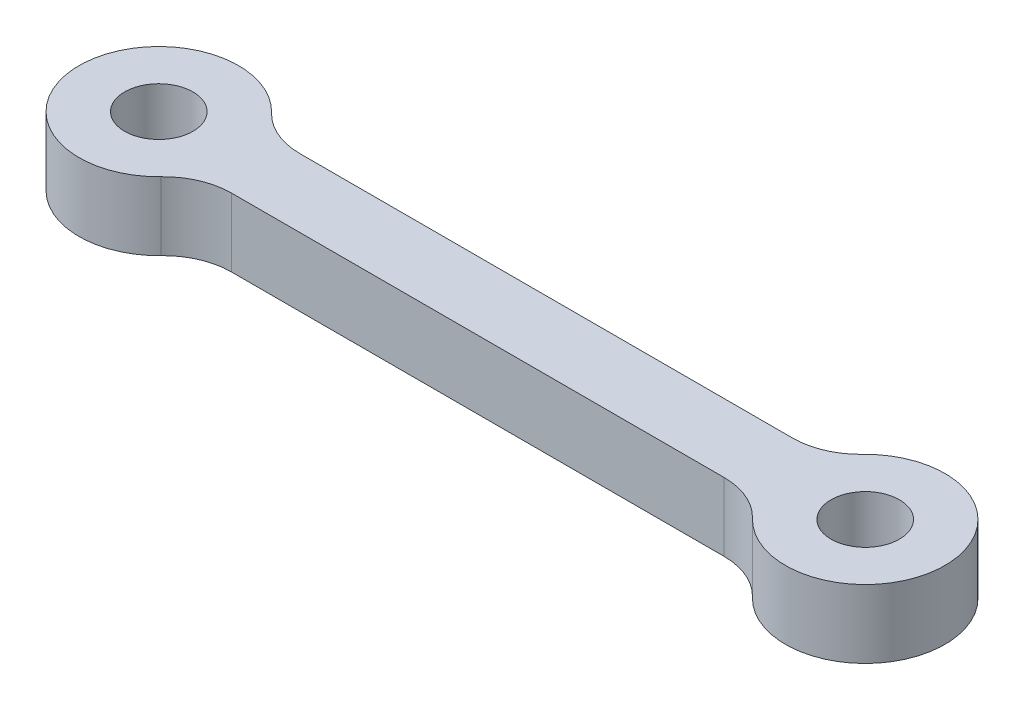
ISO-10303-21;
HEADER;
FILE_DESCRIPTION(('STEP AP214'),'2;1');
FILE_NAME('part.step','',(''),(''),'','','');
FILE_SCHEMA(('AUTOMOTIVE_DESIGN { 1 0 10303 214 1 1 1 1 }'));
ENDSEC;
DATA;
#1=APPLICATION_CONTEXT('core data for automotive mechanical design processes');
#2=APPLICATION_PROTOCOL_DEFINITION('international standard','automotive_design',2000,#1);
#3=PRODUCT_CONTEXT('',#1,'mechanical');
#4=PRODUCT('Part','Part','',(#3));
#5=PRODUCT_RELATED_PRODUCT_CATEGORY('part','',(#4));
#6=PRODUCT_DEFINITION_FORMATION('','',#4);
#7=PRODUCT_DEFINITION_CONTEXT('part definition',#1,'design');
#8=PRODUCT_DEFINITION('design','',#6,#7);
#9=PRODUCT_DEFINITION_SHAPE('','',#8);
#10=(LENGTH_UNIT() NAMED_UNIT(*) SI_UNIT(.MILLI.,.METRE.));
#11=(NAMED_UNIT(*) PLANE_ANGLE_UNIT() SI_UNIT($,.RADIAN.));
#12=(NAMED_UNIT(*) SI_UNIT($,.STERADIAN.) SOLID_ANGLE_UNIT());
#13=UNCERTAINTY_MEASURE_WITH_UNIT(LENGTH_MEASURE(1.E-05),#10,'distance_accuracy_value','');
#14=(GEOMETRIC_REPRESENTATION_CONTEXT(3) GLOBAL_UNCERTAINTY_ASSIGNED_CONTEXT((#13)) GLOBAL_UNIT_ASSIGNED_CONTEXT((#10,
#11,#12)) REPRESENTATION_CONTEXT('',''));
#15=CARTESIAN_POINT('',(0.,0.,0.));
#16=DIRECTION('',(0.,0.,1.));
#17=DIRECTION('',(1.,0.,0.));
#18=AXIS2_PLACEMENT_3D('',#15,#16,#17);
#19=CARTESIAN_POINT('',(31.,3.,0.));
#20=DIRECTION('',(0.,-1.,0.));
#21=DIRECTION('',(0.,0.,-1.));
#22=AXIS2_PLACEMENT_3D('',#19,#20,#21);
#23=CYLINDRICAL_SURFACE('',#22,3.5);
#24=CARTESIAN_POINT('',(31.,3.,0.));
#25=DIRECTION('',(0.,1.,0.));
#26=DIRECTION('',(0.,0.,1.));
#27=AXIS2_PLACEMENT_3D('',#24,#25,#26);
#28=CIRCLE('',#27,3.5);
#29=CARTESIAN_POINT('',(28.4743915139412,3.,2.42307692307692));
#30=VERTEX_POINT('',#29);
#31=CARTESIAN_POINT('',(28.4743915139412,3.,-2.42307692307692));
#32=VERTEX_POINT('',#31);
#33=EDGE_CURVE('E147',#30,#32,#28,.T.);
#34=ORIENTED_EDGE('',*,*,#33,.F.);
#35=DIRECTION('',(0.,-1.,0.));
#36=VECTOR('',#35,1.);
#37=CARTESIAN_POINT('',(28.4743915139412,3.,2.42307692307692));
#38=LINE('',#37,#36);
#39=CARTESIAN_POINT('',(28.4743915139412,0.,2.42307692307692));
#40=VERTEX_POINT('',#39);
#41=EDGE_CURVE('E155',#30,#40,#38,.T.);
#42=ORIENTED_EDGE('',*,*,#41,.T.);
#43=CARTESIAN_POINT('',(31.,0.,0.));
#44=DIRECTION('',(0.,1.,0.));
#45=DIRECTION('',(0.,0.,1.));
#46=AXIS2_PLACEMENT_3D('',#43,#44,#45);
#47=CIRCLE('',#46,3.5);
#48=CARTESIAN_POINT('',(28.4743915139412,0.,-2.42307692307692));
#49=VERTEX_POINT('',#48);
#50=EDGE_CURVE('E172',#40,#49,#47,.T.);
#51=ORIENTED_EDGE('',*,*,#50,.T.);
#52=DIRECTION('',(0.,-1.,0.));
#53=VECTOR('',#52,1.);
#54=CARTESIAN_POINT('',(28.4743915139412,3.,-2.42307692307692));
#55=LINE('',#54,#53);
#56=EDGE_CURVE('E153',#49,#32,#55,.F.);
#57=ORIENTED_EDGE('',*,*,#56,.T.);
#58=EDGE_LOOP('',(#34,#42,#51,#57));
#59=FACE_BOUND('',#58,.T.);
#60=ADVANCED_FACE('F41',(#59),#23,.T.);
#61=CARTESIAN_POINT('',(0.,3.,-1.5));
#62=DIRECTION('',(0.,0.,-1.));
#63=DIRECTION('',(-1.,0.,0.));
#64=AXIS2_PLACEMENT_3D('',#61,#62,#63);
#65=PLANE('',#64);
#66=DIRECTION('',(1.,0.,0.));
#67=VECTOR('',#66,1.);
#68=CARTESIAN_POINT('',(0.,3.,-1.5));
#69=LINE('',#68,#67);
#70=CARTESIAN_POINT('',(4.69041575982343,3.,-1.5));
#71=VERTEX_POINT('',#70);
#72=CARTESIAN_POINT('',(26.3095842401766,3.,-1.5));
#73=VERTEX_POINT('',#72);
#74=EDGE_CURVE('E179',#71,#73,#69,.T.);
#75=ORIENTED_EDGE('',*,*,#74,.T.);
#76=DIRECTION('',(0.,-1.,0.));
#77=VECTOR('',#76,1.);
#78=CARTESIAN_POINT('',(26.3095842401766,3.,-1.5));
#79=LINE('',#78,#77);
#80=CARTESIAN_POINT('',(26.3095842401766,0.,-1.5));
#81=VERTEX_POINT('',#80);
#82=EDGE_CURVE('E118',#73,#81,#79,.T.);
#83=ORIENTED_EDGE('',*,*,#82,.T.);
#84=DIRECTION('',(1.,0.,0.));
#85=VECTOR('',#84,1.);
#86=CARTESIAN_POINT('',(0.,0.,-1.5));
#87=LINE('',#86,#85);
#88=CARTESIAN_POINT('',(4.69041575982343,0.,-1.5));
#89=VERTEX_POINT('',#88);
#90=EDGE_CURVE('E141',#89,#81,#87,.T.);
#91=ORIENTED_EDGE('',*,*,#90,.F.);
#92=DIRECTION('',(0.,-1.,0.));
#93=VECTOR('',#92,1.);
#94=CARTESIAN_POINT('',(4.69041575982343,3.,-1.5));
#95=LINE('',#94,#93);
#96=EDGE_CURVE('E63',#89,#71,#95,.F.);
#97=ORIENTED_EDGE('',*,*,#96,.T.);
#98=EDGE_LOOP('',(#75,#83,#91,#97));
#99=FACE_BOUND('',#98,.T.);
#100=ADVANCED_FACE('F170',(#99),#65,.T.);
#101=CARTESIAN_POINT('',(0.,3.,0.));
#102=DIRECTION('',(0.,-1.,0.));
#103=DIRECTION('',(0.,0.,-1.));
#104=AXIS2_PLACEMENT_3D('',#101,#102,#103);
#105=CYLINDRICAL_SURFACE('',#104,3.5);
#106=CARTESIAN_POINT('',(0.,0.,0.));
#107=DIRECTION('',(0.,1.,0.));
#108=DIRECTION('',(0.,0.,1.));
#109=AXIS2_PLACEMENT_3D('',#106,#107,#108);
#110=CIRCLE('',#109,3.5);
#111=CARTESIAN_POINT('',(2.52560848605877,0.,-2.42307692307692));
#112=VERTEX_POINT('',#111);
#113=CARTESIAN_POINT('',(2.52560848605877,0.,2.42307692307692));
#114=VERTEX_POINT('',#113);
#115=EDGE_CURVE('E136',#112,#114,#110,.T.);
#116=ORIENTED_EDGE('',*,*,#115,.T.);
#117=DIRECTION('',(0.,-1.,0.));
#118=VECTOR('',#117,1.);
#119=CARTESIAN_POINT('',(2.52560848605877,3.,2.42307692307692));
#120=LINE('',#119,#118);
#121=CARTESIAN_POINT('',(2.52560848605877,3.,2.42307692307692));
#122=VERTEX_POINT('',#121);
#123=EDGE_CURVE('E112',#114,#122,#120,.F.);
#124=ORIENTED_EDGE('',*,*,#123,.T.);
#125=CARTESIAN_POINT('',(0.,3.,0.));
#126=DIRECTION('',(0.,1.,0.));
#127=DIRECTION('',(0.,0.,1.));
#128=AXIS2_PLACEMENT_3D('',#125,#126,#127);
#129=CIRCLE('',#128,3.5);
#130=CARTESIAN_POINT('',(2.52560848605877,3.,-2.42307692307692));
#131=VERTEX_POINT('',#130);
#132=EDGE_CURVE('E178',#131,#122,#129,.T.);
#133=ORIENTED_EDGE('',*,*,#132,.F.);
#134=DIRECTION('',(0.,-1.,0.));
#135=VECTOR('',#134,1.);
#136=CARTESIAN_POINT('',(2.52560848605877,3.,-2.42307692307692));
#137=LINE('',#136,#135);
#138=EDGE_CURVE('E128',#131,#112,#137,.T.);
#139=ORIENTED_EDGE('',*,*,#138,.T.);
#140=EDGE_LOOP('',(#116,#124,#133,#139));
#141=FACE_BOUND('',#140,.T.);
#142=ADVANCED_FACE('F181',(#141),#105,.T.);
#143=CARTESIAN_POINT('',(0.,3.,0.));
#144=DIRECTION('',(0.,-1.,0.));
#145=DIRECTION('',(0.,0.,-1.));
#146=AXIS2_PLACEMENT_3D('',#143,#144,#145);
#147=CYLINDRICAL_SURFACE('',#146,1.5);
#148=CARTESIAN_POINT('',(0.,3.,0.));
#149=DIRECTION('',(0.,1.,0.));
#150=DIRECTION('',(0.,0.,1.));
#151=AXIS2_PLACEMENT_3D('',#148,#149,#150);
#152=CIRCLE('',#151,1.5);
#153=CARTESIAN_POINT('',(0.,3.,1.5));
#154=VERTEX_POINT('',#153);
#155=EDGE_CURVE('E183',#154,#154,#152,.T.);
#156=ORIENTED_EDGE('',*,*,#155,.T.);
#157=EDGE_LOOP('',(#156));
#158=FACE_BOUND('',#157,.T.);
#159=CARTESIAN_POINT('',(0.,0.,0.));
#160=DIRECTION('',(0.,1.,0.));
#161=DIRECTION('',(0.,0.,1.));
#162=AXIS2_PLACEMENT_3D('',#159,#160,#161);
#163=CIRCLE('',#162,1.5);
#164=CARTESIAN_POINT('',(0.,0.,1.5));
#165=VERTEX_POINT('',#164);
#166=EDGE_CURVE('E135',#165,#165,#163,.T.);
#167=ORIENTED_EDGE('',*,*,#166,.F.);
#168=EDGE_LOOP('',(#167));
#169=FACE_BOUND('',#168,.T.);
#170=ADVANCED_FACE('F229',(#158,#169),#147,.F.);
#171=CARTESIAN_POINT('',(0.,3.,1.5));
#172=DIRECTION('',(0.,0.,-1.));
#173=DIRECTION('',(-1.,0.,0.));
#174=AXIS2_PLACEMENT_3D('',#171,#172,#173);
#175=PLANE('',#174);
#176=DIRECTION('',(1.,0.,0.));
#177=VECTOR('',#176,1.);
#178=CARTESIAN_POINT('',(0.,3.,1.5));
#179=LINE('',#178,#177);
#180=CARTESIAN_POINT('',(4.69041575982343,3.,1.5));
#181=VERTEX_POINT('',#180);
#182=CARTESIAN_POINT('',(26.3095842401766,3.,1.5));
#183=VERTEX_POINT('',#182);
#184=EDGE_CURVE('E127',#181,#183,#179,.T.);
#185=ORIENTED_EDGE('',*,*,#184,.F.);
#186=DIRECTION('',(0.,1.,0.));
#187=VECTOR('',#186,1.);
#188=CARTESIAN_POINT('',(4.69041575982343,0.,1.5));
#189=LINE('',#188,#187);
#190=CARTESIAN_POINT('',(4.69041575982343,0.,1.5));
#191=VERTEX_POINT('',#190);
#192=EDGE_CURVE('E111',#181,#191,#189,.F.);
#193=ORIENTED_EDGE('',*,*,#192,.T.);
#194=DIRECTION('',(1.,0.,0.));
#195=VECTOR('',#194,1.);
#196=CARTESIAN_POINT('',(0.,0.,1.5));
#197=LINE('',#196,#195);
#198=CARTESIAN_POINT('',(26.3095842401766,0.,1.5));
#199=VERTEX_POINT('',#198);
#200=EDGE_CURVE('E124',#191,#199,#197,.T.);
#201=ORIENTED_EDGE('',*,*,#200,.T.);
#202=DIRECTION('',(0.,1.,0.));
#203=VECTOR('',#202,1.);
#204=CARTESIAN_POINT('',(26.3095842401766,3.,1.5));
#205=LINE('',#204,#203);
#206=EDGE_CURVE('E129',#199,#183,#205,.T.);
#207=ORIENTED_EDGE('',*,*,#206,.T.);
#208=EDGE_LOOP('',(#185,#193,#201,#207));
#209=FACE_BOUND('',#208,.T.);
#210=ADVANCED_FACE('F123',(#209),#175,.F.);
#211=CARTESIAN_POINT('',(31.,3.,0.));
#212=DIRECTION('',(0.,-1.,0.));
#213=DIRECTION('',(0.,0.,-1.));
#214=AXIS2_PLACEMENT_3D('',#211,#212,#213);
#215=CYLINDRICAL_SURFACE('',#214,1.5);
#216=CARTESIAN_POINT('',(31.,3.,0.));
#217=DIRECTION('',(0.,1.,0.));
#218=DIRECTION('',(0.,0.,1.));
#219=AXIS2_PLACEMENT_3D('',#216,#217,#218);
#220=CIRCLE('',#219,1.5);
#221=CARTESIAN_POINT('',(31.,3.,1.5));
#222=VERTEX_POINT('',#221);
#223=EDGE_CURVE('E148',#222,#222,#220,.T.);
#224=ORIENTED_EDGE('',*,*,#223,.T.);
#225=EDGE_LOOP('',(#224));
#226=FACE_BOUND('',#225,.T.);
#227=CARTESIAN_POINT('',(31.,0.,0.));
#228=DIRECTION('',(0.,1.,0.));
#229=DIRECTION('',(0.,0.,1.));
#230=AXIS2_PLACEMENT_3D('',#227,#228,#229);
#231=CIRCLE('',#230,1.5);
#232=CARTESIAN_POINT('',(31.,0.,1.5));
#233=VERTEX_POINT('',#232);
#234=EDGE_CURVE('E139',#233,#233,#231,.T.);
#235=ORIENTED_EDGE('',*,*,#234,.F.);
#236=EDGE_LOOP('',(#235));
#237=FACE_BOUND('',#236,.T.);
#238=ADVANCED_FACE('F223',(#226,#237),#215,.F.);
#239=CARTESIAN_POINT('',(0.,3.,0.));
#240=DIRECTION('',(0.,1.,0.));
#241=DIRECTION('',(0.,0.,1.));
#242=AXIS2_PLACEMENT_3D('',#239,#240,#241);
#243=PLANE('',#242);
#244=ORIENTED_EDGE('',*,*,#184,.T.);
#245=CARTESIAN_POINT('',(26.3095842401766,3.,4.5));
#246=DIRECTION('',(0.,1.,0.));
#247=DIRECTION('',(0.,0.,1.));
#248=AXIS2_PLACEMENT_3D('',#245,#246,#247);
#249=CIRCLE('',#248,3.);
#250=EDGE_CURVE('E163',#183,#30,#249,.F.);
#251=ORIENTED_EDGE('',*,*,#250,.T.);
#252=ORIENTED_EDGE('',*,*,#33,.T.);
#253=CARTESIAN_POINT('',(26.3095842401766,3.,-4.5));
#254=DIRECTION('',(0.,1.,0.));
#255=DIRECTION('',(0.,0.,1.));
#256=AXIS2_PLACEMENT_3D('',#253,#254,#255);
#257=CIRCLE('',#256,3.);
#258=EDGE_CURVE('E56',#32,#73,#257,.F.);
#259=ORIENTED_EDGE('',*,*,#258,.T.);
#260=ORIENTED_EDGE('',*,*,#74,.F.);
#261=CARTESIAN_POINT('',(4.69041575982343,3.,-4.5));
#262=DIRECTION('',(0.,1.,0.));
#263=DIRECTION('',(0.,0.,1.));
#264=AXIS2_PLACEMENT_3D('',#261,#262,#263);
#265=CIRCLE('',#264,3.);
#266=EDGE_CURVE('E11',#71,#131,#265,.F.);
#267=ORIENTED_EDGE('',*,*,#266,.T.);
#268=ORIENTED_EDGE('',*,*,#132,.T.);
#269=CARTESIAN_POINT('',(4.69041575982343,3.,4.5));
#270=DIRECTION('',(0.,1.,0.));
#271=DIRECTION('',(0.,0.,1.));
#272=AXIS2_PLACEMENT_3D('',#269,#270,#271);
#273=CIRCLE('',#272,3.);
#274=EDGE_CURVE('E117',#122,#181,#273,.F.);
#275=ORIENTED_EDGE('',*,*,#274,.T.);
#276=EDGE_LOOP('',(#244,#251,#252,#259,#260,#267,#268,#275));
#277=FACE_BOUND('',#276,.T.);
#278=ORIENTED_EDGE('',*,*,#155,.F.);
#279=EDGE_LOOP('',(#278));
#280=FACE_BOUND('',#279,.T.);
#281=ORIENTED_EDGE('',*,*,#223,.F.);
#282=EDGE_LOOP('',(#281));
#283=FACE_BOUND('',#282,.T.);
#284=ADVANCED_FACE('F176',(#277,#280,#283),#243,.T.);
#285=CARTESIAN_POINT('',(0.,0.,0.));
#286=DIRECTION('',(0.,1.,0.));
#287=DIRECTION('',(0.,0.,1.));
#288=AXIS2_PLACEMENT_3D('',#285,#286,#287);
#289=PLANE('',#288);
#290=ORIENTED_EDGE('',*,*,#50,.F.);
#291=CARTESIAN_POINT('',(26.3095842401766,0.,4.5));
#292=DIRECTION('',(0.,1.,0.));
#293=DIRECTION('',(0.,0.,1.));
#294=AXIS2_PLACEMENT_3D('',#291,#292,#293);
#295=CIRCLE('',#294,3.);
#296=EDGE_CURVE('E134',#40,#199,#295,.T.);
#297=ORIENTED_EDGE('',*,*,#296,.T.);
#298=ORIENTED_EDGE('',*,*,#200,.F.);
#299=CARTESIAN_POINT('',(4.69041575982343,0.,4.5));
#300=DIRECTION('',(0.,1.,0.));
#301=DIRECTION('',(0.,0.,1.));
#302=AXIS2_PLACEMENT_3D('',#299,#300,#301);
#303=CIRCLE('',#302,3.);
#304=EDGE_CURVE('E107',#191,#114,#303,.T.);
#305=ORIENTED_EDGE('',*,*,#304,.T.);
#306=ORIENTED_EDGE('',*,*,#115,.F.);
#307=CARTESIAN_POINT('',(4.69041575982343,0.,-4.5));
#308=DIRECTION('',(0.,1.,0.));
#309=DIRECTION('',(0.,0.,1.));
#310=AXIS2_PLACEMENT_3D('',#307,#308,#309);
#311=CIRCLE('',#310,3.);
#312=EDGE_CURVE('E49',#112,#89,#311,.T.);
#313=ORIENTED_EDGE('',*,*,#312,.T.);
#314=ORIENTED_EDGE('',*,*,#90,.T.);
#315=CARTESIAN_POINT('',(26.3095842401766,0.,-4.5));
#316=DIRECTION('',(0.,1.,0.));
#317=DIRECTION('',(0.,0.,1.));
#318=AXIS2_PLACEMENT_3D('',#315,#316,#317);
#319=CIRCLE('',#318,3.);
#320=EDGE_CURVE('E165',#81,#49,#319,.T.);
#321=ORIENTED_EDGE('',*,*,#320,.T.);
#322=EDGE_LOOP('',(#290,#297,#298,#305,#306,#313,#314,#321));
#323=FACE_BOUND('',#322,.T.);
#324=ORIENTED_EDGE('',*,*,#166,.T.);
#325=EDGE_LOOP('',(#324));
#326=FACE_BOUND('',#325,.T.);
#327=ORIENTED_EDGE('',*,*,#234,.T.);
#328=EDGE_LOOP('',(#327));
#329=FACE_BOUND('',#328,.T.);
#330=ADVANCED_FACE('F132',(#323,#326,#329),#289,.F.);
#331=CARTESIAN_POINT('',(4.69041575982343,3.,4.5));
#332=DIRECTION('',(0.,-1.,0.));
#333=DIRECTION('',(0.,0.,-1.));
#334=AXIS2_PLACEMENT_3D('',#331,#332,#333);
#335=CYLINDRICAL_SURFACE('',#334,3.);
#336=ORIENTED_EDGE('',*,*,#274,.F.);
#337=ORIENTED_EDGE('',*,*,#123,.F.);
#338=ORIENTED_EDGE('',*,*,#304,.F.);
#339=ORIENTED_EDGE('',*,*,#192,.F.);
#340=EDGE_LOOP('',(#336,#337,#338,#339));
#341=FACE_BOUND('',#340,.T.);
#342=ADVANCED_FACE('F110',(#341),#335,.F.);
#343=CARTESIAN_POINT('',(26.3095842401766,3.,4.5));
#344=DIRECTION('',(0.,-1.,0.));
#345=DIRECTION('',(0.,0.,-1.));
#346=AXIS2_PLACEMENT_3D('',#343,#344,#345);
#347=CYLINDRICAL_SURFACE('',#346,3.);
#348=ORIENTED_EDGE('',*,*,#250,.F.);
#349=ORIENTED_EDGE('',*,*,#206,.F.);
#350=ORIENTED_EDGE('',*,*,#296,.F.);
#351=ORIENTED_EDGE('',*,*,#41,.F.);
#352=EDGE_LOOP('',(#348,#349,#350,#351));
#353=FACE_BOUND('',#352,.T.);
#354=ADVANCED_FACE('F200',(#353),#347,.F.);
#355=CARTESIAN_POINT('',(26.3095842401766,3.,-4.5));
#356=DIRECTION('',(0.,-1.,0.));
#357=DIRECTION('',(0.,0.,-1.));
#358=AXIS2_PLACEMENT_3D('',#355,#356,#357);
#359=CYLINDRICAL_SURFACE('',#358,3.);
#360=ORIENTED_EDGE('',*,*,#258,.F.);
#361=ORIENTED_EDGE('',*,*,#56,.F.);
#362=ORIENTED_EDGE('',*,*,#320,.F.);
#363=ORIENTED_EDGE('',*,*,#82,.F.);
#364=EDGE_LOOP('',(#360,#361,#362,#363));
#365=FACE_BOUND('',#364,.T.);
#366=ADVANCED_FACE('F198',(#365),#359,.F.);
#367=CARTESIAN_POINT('',(4.69041575982343,3.,-4.5));
#368=DIRECTION('',(0.,-1.,0.));
#369=DIRECTION('',(0.,0.,-1.));
#370=AXIS2_PLACEMENT_3D('',#367,#368,#369);
#371=CYLINDRICAL_SURFACE('',#370,3.);
#372=ORIENTED_EDGE('',*,*,#266,.F.);
#373=ORIENTED_EDGE('',*,*,#96,.F.);
#374=ORIENTED_EDGE('',*,*,#312,.F.);
#375=ORIENTED_EDGE('',*,*,#138,.F.);
#376=EDGE_LOOP('',(#372,#373,#374,#375));
#377=FACE_BOUND('',#376,.T.);
#378=ADVANCED_FACE('F43',(#377),#371,.F.);
#379=CLOSED_SHELL('',(#60,#100,#142,#170,#210,#238,#284,#330,#342,#354,#366,#378));
#380=MANIFOLD_SOLID_BREP('B2',#379);
#381=ADVANCED_BREP_SHAPE_REPRESENTATION('',(#18,#380),#14);
#382=SHAPE_DEFINITION_REPRESENTATION(#9,#381);
ENDSEC;
END-ISO-10303-21;
